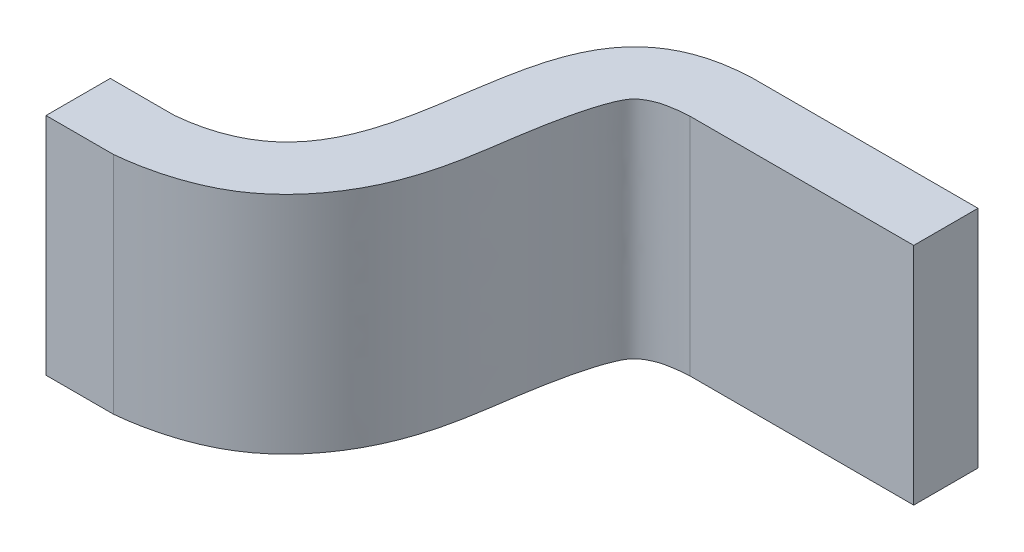
ISO-10303-21;
HEADER;
FILE_DESCRIPTION(('STEP AP214'),'2;1');
FILE_NAME('part.step','',(''),(''),'','','');
FILE_SCHEMA(('AUTOMOTIVE_DESIGN { 1 0 10303 214 1 1 1 1 }'));
ENDSEC;
DATA;
#1=APPLICATION_CONTEXT('core data for automotive mechanical design processes');
#2=APPLICATION_PROTOCOL_DEFINITION('international standard','automotive_design',2000,#1);
#3=PRODUCT_CONTEXT('',#1,'mechanical');
#4=PRODUCT('Part','Part','',(#3));
#5=PRODUCT_RELATED_PRODUCT_CATEGORY('part','',(#4));
#6=PRODUCT_DEFINITION_FORMATION('','',#4);
#7=PRODUCT_DEFINITION_CONTEXT('part definition',#1,'design');
#8=PRODUCT_DEFINITION('design','',#6,#7);
#9=PRODUCT_DEFINITION_SHAPE('','',#8);
#10=(LENGTH_UNIT() NAMED_UNIT(*) SI_UNIT(.MILLI.,.METRE.));
#11=(NAMED_UNIT(*) PLANE_ANGLE_UNIT() SI_UNIT($,.RADIAN.));
#12=(NAMED_UNIT(*) SI_UNIT($,.STERADIAN.) SOLID_ANGLE_UNIT());
#13=UNCERTAINTY_MEASURE_WITH_UNIT(LENGTH_MEASURE(1.E-05),#10,'distance_accuracy_value','');
#14=(GEOMETRIC_REPRESENTATION_CONTEXT(3) GLOBAL_UNCERTAINTY_ASSIGNED_CONTEXT((#13)) GLOBAL_UNIT_ASSIGNED_CONTEXT((#10,
#11,#12)) REPRESENTATION_CONTEXT('',''));
#15=CARTESIAN_POINT('',(0.,0.,0.));
#16=DIRECTION('',(0.,0.,1.));
#17=DIRECTION('',(1.,0.,0.));
#18=AXIS2_PLACEMENT_3D('',#15,#16,#17);
#19=CARTESIAN_POINT('',(0.381074398756027,0.523099170325608,1.2000000284124));
#20=DIRECTION('',(0.,1.,4.37113882867379E-08));
#21=DIRECTION('',(-1.,0.,0.));
#22=AXIS2_PLACEMENT_3D('',#19,#20,#21);
#23=PLANE('',#22);
#24=DIRECTION('',(1.,0.,0.));
#25=VECTOR('',#24,1.);
#26=CARTESIAN_POINT('',(8.21957818049203,0.523099214036997,0.200000028412402));
#27=LINE('',#26,#25);
#28=CARTESIAN_POINT('',(8.21957818049203,0.523099214036996,0.200000028412402));
#29=VERTEX_POINT('',#28);
#30=CARTESIAN_POINT('',(8.91607439875603,0.523099214036996,0.200000028412402));
#31=VERTEX_POINT('',#30);
#32=EDGE_CURVE('E11',#29,#31,#27,.T.);
#33=ORIENTED_EDGE('',*,*,#32,.F.);
#34=CARTESIAN_POINT('',(8.21957818049203,0.523099214036996,0.200000028412402));
#35=CARTESIAN_POINT('',(8.21401047042364,0.523099214027263,0.200222689522129));
#36=CARTESIAN_POINT('',(8.2084492375196,0.52309921401197,0.200572554479812));
#37=CARTESIAN_POINT('',(8.19734075645456,0.523099213971401,0.201500686980735));
#38=CARTESIAN_POINT('',(8.19179352491145,0.523099213946115,0.202079155292227));
#39=CARTESIAN_POINT('',(8.1806812900785,0.523099213886489,0.203443235011885));
#40=CARTESIAN_POINT('',(8.17511647873245,0.52309921385208,0.204230406804731));
#41=CARTESIAN_POINT('',(8.16402483417436,0.523099213773333,0.206031938032742));
#42=CARTESIAN_POINT('',(8.15849799412173,0.523099213728996,0.207046255379066));
#43=CARTESIAN_POINT('',(8.14658674806992,0.523099213616172,0.209627352515907));
#44=CARTESIAN_POINT('',(8.14021486717337,0.523099213544873,0.211258445573229));
#45=CARTESIAN_POINT('',(8.12922884181096,0.523099213386304,0.214886194813636));
#46=CARTESIAN_POINT('',(8.12455816053053,0.523099213306908,0.216702673148475));
#47=CARTESIAN_POINT('',(8.11576316126025,0.523099213130285,0.220743053151341));
#48=CARTESIAN_POINT('',(8.11162296951039,0.523099213034502,0.222933941860097));
#49=CARTESIAN_POINT('',(8.10254423156373,0.52309921280851,0.228105201448087));
#50=CARTESIAN_POINT('',(8.09763875402522,0.523099212675429,0.231151708136344));
#51=CARTESIAN_POINT('',(8.09023645619511,0.523099212418264,0.237031406996282));
#52=CARTESIAN_POINT('',(8.08750404217203,0.523099212307858,0.239554098690419));
#53=CARTESIAN_POINT('',(8.08247327048636,0.523099212070041,0.245002743933273));
#54=CARTESIAN_POINT('',(8.08017570164472,0.523099211942599,0.24792941399559));
#55=CARTESIAN_POINT('',(8.07600750655781,0.523099211678791,0.253960548834216));
#56=CARTESIAN_POINT('',(8.0741279129576,0.523099211542714,0.257059016316078));
#57=CARTESIAN_POINT('',(8.07061884711942,0.523099211266161,0.263392895839743));
#58=CARTESIAN_POINT('',(8.06898949912774,0.523099211125682,0.266628374896966));
#59=CARTESIAN_POINT('',(8.06368568552224,0.523099210637886,0.277849874002462));
#60=CARTESIAN_POINT('',(8.0604132563502,0.523099210281663,0.286022060199967));
#61=CARTESIAN_POINT('',(8.05219767575064,0.52309920930258,0.308422171614174));
#62=CARTESIAN_POINT('',(8.04772694785476,0.523099208670707,0.322813264888977));
#63=CARTESIAN_POINT('',(8.03962993037267,0.523099207415631,0.351469930130034));
#64=CARTESIAN_POINT('',(8.03598677320327,0.523099206792557,0.365730933740905));
#65=CARTESIAN_POINT('',(8.0292057912753,0.52309920554127,0.394362148604284));
#66=CARTESIAN_POINT('',(8.026067670572,0.523099204913059,0.408732290694727));
#67=CARTESIAN_POINT('',(8.01737649852023,0.523099203059267,0.451139552140372));
#68=CARTESIAN_POINT('',(8.01233758089064,0.52309920182914,0.479282765244955));
#69=CARTESIAN_POINT('',(8.0033688768371,0.523099199358243,0.535811203708825));
#70=CARTESIAN_POINT('',(7.99944209123785,0.523099198117453,0.564196874894819));
#71=CARTESIAN_POINT('',(7.99171406777027,0.523099195864869,0.615729796034541));
#72=CARTESIAN_POINT('',(7.98801955213797,0.523099194852412,0.638892139061332));
#73=CARTESIAN_POINT('',(7.97944793328662,0.52309919283672,0.685005838505779));
#74=CARTESIAN_POINT('',(7.97457098452208,0.523099191833482,0.707957222073791));
#75=CARTESIAN_POINT('',(7.96312511462686,0.523099189850104,0.753331627106404));
#76=CARTESIAN_POINT('',(7.95656434385538,0.523099188869875,0.775756641066975));
#77=CARTESIAN_POINT('',(7.94138023978948,0.523099186940585,0.819893680216221));
#78=CARTESIAN_POINT('',(7.93275798105253,0.523099185991507,0.841606070178963));
#79=CARTESIAN_POINT('',(7.91045031887107,0.523099183869217,0.890158404680553));
#80=CARTESIAN_POINT('',(7.89602176505835,0.523099182710677,0.916662671017734));
#81=CARTESIAN_POINT('',(7.86348674764205,0.523099180492291,0.967413431258293));
#82=CARTESIAN_POINT('',(7.84537217243352,0.523099179432669,0.991654770611745));
#83=CARTESIAN_POINT('',(7.80791242379023,0.523099177574198,1.03417163444858));
#84=CARTESIAN_POINT('',(7.78898672481745,0.523099176759306,1.0528141777067));
#85=CARTESIAN_POINT('',(7.74845805610151,0.523099175272559,1.08682698482442));
#86=CARTESIAN_POINT('',(7.72686395650978,0.523099174600248,1.10220765192534));
#87=CARTESIAN_POINT('',(7.68360712676313,0.523099173481253,1.12780728885139));
#88=CARTESIAN_POINT('',(7.66215097272192,0.523099173019081,1.13838054359417));
#89=CARTESIAN_POINT('',(7.61807803282734,0.523099172208481,1.15692492218508));
#90=CARTESIAN_POINT('',(7.59545709543127,0.523099171860497,1.16488586802287));
#91=CARTESIAN_POINT('',(7.54849735175116,0.523099171251631,1.17881510607821));
#92=CARTESIAN_POINT('',(7.52412722595023,0.523099170995436,1.18467615175865));
#93=CARTESIAN_POINT('',(7.47515350623731,0.523099170586624,1.19402868396041));
#94=CARTESIAN_POINT('',(7.45055381030961,0.523099170433121,1.19754041861071));
#95=CARTESIAN_POINT('',(7.42587357560403,0.523099170325609,1.2000000284124));
#96=B_SPLINE_CURVE_WITH_KNOTS('',3,(#34,#35,#36,#37,#38,#39,#40,#41,#42,#43,#44,#45,#46,#47,#48,
#49,#50,#51,#52,#53,#54,#55,#56,#57,#58,#59,#60,#61,#62,#63,#64,#65,#66,#67,#68,#69,#70,#71,#72,
#73,#74,#75,#76,#77,#78,#79,#80,#81,#82,#83,#84,#85,#86,#87,#88,#89,#90,#91,#92,#93,#94,#95),
.UNSPECIFIED.,.F.,.F.,(4,2,2,2,2,2,2,2,2,2,2,2,2,2,2,2,2,2,2,2,2,2,2,2,2,2,2,2,2,2,4),(0.,
0.0167129049826574,0.0334405206169266,0.0502969119078462,0.0671501823813316,0.086844997792569,
0.101838970321099,0.115885127156855,0.133132127804881,0.144236213112229,0.155360252414292,
0.166215762863012,0.177076645740442,0.203446553112077,0.248618617741093,0.292765096579114,
0.336885611219413,0.42262238002304,0.508588331833535,0.578941414817071,0.649285312924718,
0.719294937731862,0.789268149044624,0.879502218060837,0.969937050040235,1.04934324822107,
1.12849225200605,1.20002463783801,1.27183250557102,1.34691026454657,1.42133231106535),.UNSPECIFIED.);
#97=CARTESIAN_POINT('',(7.42587357560403,0.523099170325608,1.2000000284124));
#98=VERTEX_POINT('',#97);
#99=EDGE_CURVE('E186',#29,#98,#96,.T.);
#100=ORIENTED_EDGE('',*,*,#99,.T.);
#101=DIRECTION('',(1.,0.,0.));
#102=VECTOR('',#101,1.);
#103=CARTESIAN_POINT('',(7.21607439875603,0.523099170325608,1.2000000284124));
#104=LINE('',#103,#102);
#105=CARTESIAN_POINT('',(7.21607439875603,0.523099170325608,1.2000000284124));
#106=VERTEX_POINT('',#105);
#107=EDGE_CURVE('E163',#106,#98,#104,.T.);
#108=ORIENTED_EDGE('',*,*,#107,.F.);
#109=DIRECTION('',(0.,4.37113883977602E-08,-0.999999999999999));
#110=VECTOR('',#109,1.);
#111=CARTESIAN_POINT('',(7.21607439875603,0.523099170325608,1.2000000284124));
#112=LINE('',#111,#110);
#113=CARTESIAN_POINT('',(7.21607439875603,0.523099179067886,1.0000000284124));
#114=VERTEX_POINT('',#113);
#115=EDGE_CURVE('E155',#106,#114,#112,.T.);
#116=ORIENTED_EDGE('',*,*,#115,.T.);
#117=DIRECTION('',(-1.,0.,0.));
#118=VECTOR('',#117,1.);
#119=CARTESIAN_POINT('',(7.41607439875603,0.523099179067886,1.0000000284124));
#120=LINE('',#119,#118);
#121=CARTESIAN_POINT('',(7.41607439875603,0.523099179067886,1.0000000284124));
#122=VERTEX_POINT('',#121);
#123=EDGE_CURVE('E148',#122,#114,#120,.T.);
#124=ORIENTED_EDGE('',*,*,#123,.F.);
#125=CARTESIAN_POINT('',(8.21607439875603,0.523099222779274,2.84124024121632E-08));
#126=CARTESIAN_POINT('',(8.19359750090305,0.523099222746405,0.000751973045807773));
#127=CARTESIAN_POINT('',(8.17102033253113,0.523099222668732,0.00252892635576605));
#128=CARTESIAN_POINT('',(8.12598549255526,0.523099222386471,0.00898631281109906));
#129=CARTESIAN_POINT('',(8.10353378116303,0.523099222180145,0.0137065199884034));
#130=CARTESIAN_POINT('',(8.06516605596456,0.523099221673949,0.0252869208885335));
#131=CARTESIAN_POINT('',(8.04901169028135,0.523099221410038,0.031324499649534));
#132=CARTESIAN_POINT('',(8.01790380459713,0.523099220776571,0.0458165330653715));
#133=CARTESIAN_POINT('',(8.00294442627384,0.523099220407577,0.0542581347862217));
#134=CARTESIAN_POINT('',(7.97582167191426,0.523099219594948,0.0728489137987578));
#135=CARTESIAN_POINT('',(7.96353091436025,0.52309921915947,0.0828114897177462));
#136=CARTESIAN_POINT('',(7.94070621502396,0.523099218207211,0.104596633966456));
#137=CARTESIAN_POINT('',(7.93017445817697,0.523099217690331,0.116421480619358));
#138=CARTESIAN_POINT('',(7.90935508116188,0.523099216502098,0.143605077884773));
#139=CARTESIAN_POINT('',(7.89940970116877,0.523099215819404,0.159223306458098));
#140=CARTESIAN_POINT('',(7.88179108799282,0.523099214399586,0.191704937205948));
#141=CARTESIAN_POINT('',(7.8741236490106,0.523099213662331,0.208571380664586));
#142=CARTESIAN_POINT('',(7.85832464058284,0.523099211903736,0.248803345104274));
#143=CARTESIAN_POINT('',(7.85090890706547,0.523099210870456,0.272442033282066));
#144=CARTESIAN_POINT('',(7.83820894045458,0.523099208781532,0.320231039974889));
#145=CARTESIAN_POINT('',(7.83292359852321,0.5230992077259,0.344381085428394));
#146=CARTESIAN_POINT('',(7.82020763349268,0.523099204851882,0.41013095442911));
#147=CARTESIAN_POINT('',(7.81392194525158,0.523099203024599,0.451934314660285));
#148=CARTESIAN_POINT('',(7.8012428083788,0.523099199360207,0.535765841283036));
#149=CARTESIAN_POINT('',(7.79484895474965,0.5230991975231,0.577793964269862));
#150=CARTESIAN_POINT('',(7.78273984807099,0.523099194831536,0.6393697611756));
#151=CARTESIAN_POINT('',(7.77842057810017,0.523099193965965,0.659171695464004));
#152=CARTESIAN_POINT('',(7.76847573352189,0.523099192248105,0.698471750789638));
#153=CARTESIAN_POINT('',(7.76284917548215,0.523099191395826,0.717969631254135));
#154=CARTESIAN_POINT('',(7.74981596903728,0.523099189726678,0.756155277243099));
#155=CARTESIAN_POINT('',(7.74242864611761,0.523099188909532,0.774849402330933));
#156=CARTESIAN_POINT('',(7.72530005700014,0.523099187324708,0.811105960776874));
#157=CARTESIAN_POINT('',(7.71556458954354,0.523099186556914,0.828671049014009));
#158=CARTESIAN_POINT('',(7.69292951988902,0.523099185076476,0.862539528703549));
#159=CARTESIAN_POINT('',(7.67993520495926,0.523099184366525,0.878781289982295));
#160=CARTESIAN_POINT('',(7.65100399267901,0.523099183072226,0.908391388716109));
#161=CARTESIAN_POINT('',(7.63506980602138,0.523099182487762,0.92176234880261));
#162=CARTESIAN_POINT('',(7.60252456066282,0.523099181513851,0.944042841853134));
#163=CARTESIAN_POINT('',(7.58611569627056,0.523099181111289,0.9532524144854));
#164=CARTESIAN_POINT('',(7.55201487673193,0.523099180421609,0.969030441043198));
#165=CARTESIAN_POINT('',(7.53431790582258,0.523099180134976,0.975587838389975));
#166=CARTESIAN_POINT('',(7.4998876879737,0.523099179685129,0.985879127327204));
#167=CARTESIAN_POINT('',(7.48321202321778,0.523099179513099,0.989814734575921));
#168=CARTESIAN_POINT('',(7.44972396115948,0.523099179241149,0.996036229262667));
#169=CARTESIAN_POINT('',(7.43291463042139,0.523099179140522,0.998338325880507));
#170=CARTESIAN_POINT('',(7.41607439875603,0.523099179067885,1.0000000284124));
#171=B_SPLINE_CURVE_WITH_KNOTS('',3,(#125,#126,#127,#128,#129,#130,#131,#132,#133,#134,#135,
#136,#137,#138,#139,#140,#141,#142,#143,#144,#145,#146,#147,#148,#149,#150,#151,#152,#153,#154,
#155,#156,#157,#158,#159,#160,#161,#162,#163,#164,#165,#166,#167,#168,#169,#170),.UNSPECIFIED.,
.F.,.F.,(4,2,2,2,2,2,2,2,2,2,2,2,2,2,2,2,2,2,2,2,2,2,4),(0.,0.0676605368254357,
0.136255841823746,0.187815232472052,0.239103979458826,0.286357475935169,0.333669238509407,
0.388978971846573,0.444428210357162,0.518581097757565,0.592695339665638,0.719482422739696,
0.846974988060582,0.90774680548486,0.96856448853661,1.02874313069962,1.08877465652057,
1.15080863583324,1.21278570033355,1.26897458836371,1.32539536427915,1.3767136749948,
1.42751535438906),.UNSPECIFIED.);
#172=CARTESIAN_POINT('',(8.21607439875603,0.523099222779274,2.84124023863797E-08));
#173=VERTEX_POINT('',#172);
#174=EDGE_CURVE('E99',#173,#122,#171,.T.);
#175=ORIENTED_EDGE('',*,*,#174,.F.);
#176=DIRECTION('',(1.,0.,0.));
#177=VECTOR('',#176,1.);
#178=CARTESIAN_POINT('',(8.21607439875603,0.523099222779274,2.84124023863797E-08));
#179=LINE('',#178,#177);
#180=CARTESIAN_POINT('',(8.91607439875603,0.523099222779274,2.84124023863797E-08));
#181=VERTEX_POINT('',#180);
#182=EDGE_CURVE('E93',#173,#181,#179,.T.);
#183=ORIENTED_EDGE('',*,*,#182,.T.);
#184=DIRECTION('',(0.,4.37113883977602E-08,-0.999999999999999));
#185=VECTOR('',#184,1.);
#186=CARTESIAN_POINT('',(8.91607439875603,0.523099214036996,0.200000028412402));
#187=LINE('',#186,#185);
#188=EDGE_CURVE('E194',#31,#181,#187,.T.);
#189=ORIENTED_EDGE('',*,*,#188,.F.);
#190=EDGE_LOOP('',(#33,#100,#108,#116,#124,#175,#183,#189));
#191=FACE_BOUND('',#190,.T.);
#192=ADVANCED_FACE('F17',(#191),#23,.F.);
#193=CARTESIAN_POINT('',(8.91607439875603,-0.126900829674392,1.2));
#194=DIRECTION('',(-1.,0.,0.));
#195=DIRECTION('',(0.,-1.,-4.37113882867379E-08));
#196=AXIS2_PLACEMENT_3D('',#193,#194,#195);
#197=PLANE('',#196);
#198=DIRECTION('',(0.,-0.999999999999999,-4.37113881598552E-08));
#199=VECTOR('',#198,1.);
#200=CARTESIAN_POINT('',(8.91607439875603,1.223099214037,0.200000059010374));
#201=LINE('',#200,#199);
#202=CARTESIAN_POINT('',(8.91607439875603,1.223099214037,0.200000059010374));
#203=VERTEX_POINT('',#202);
#204=EDGE_CURVE('E25',#203,#31,#201,.T.);
#205=ORIENTED_EDGE('',*,*,#204,.T.);
#206=ORIENTED_EDGE('',*,*,#188,.T.);
#207=DIRECTION('',(0.,0.999999999999999,4.37113882867379E-08));
#208=VECTOR('',#207,1.);
#209=CARTESIAN_POINT('',(8.91607439875603,0.523099222779274,2.84124023863797E-08));
#210=LINE('',#209,#208);
#211=CARTESIAN_POINT('',(8.91607439875603,1.22309922277927,5.90103741870962E-08));
#212=VERTEX_POINT('',#211);
#213=EDGE_CURVE('E157',#181,#212,#210,.T.);
#214=ORIENTED_EDGE('',*,*,#213,.T.);
#215=DIRECTION('',(0.,4.37113878426487E-08,-0.999999999999999));
#216=VECTOR('',#215,1.);
#217=CARTESIAN_POINT('',(8.91607439875603,1.223099214037,0.200000059010374));
#218=LINE('',#217,#216);
#219=EDGE_CURVE('E150',#203,#212,#218,.T.);
#220=ORIENTED_EDGE('',*,*,#219,.F.);
#221=EDGE_LOOP('',(#205,#206,#214,#220));
#222=FACE_BOUND('',#221,.T.);
#223=ADVANCED_FACE('F205',(#222),#197,.F.);
#224=CARTESIAN_POINT('',(0.381074398756027,1.22309917032561,1.20000005901037));
#225=DIRECTION('',(0.,1.,4.37113882867379E-08));
#226=DIRECTION('',(-1.,0.,0.));
#227=AXIS2_PLACEMENT_3D('',#224,#225,#226);
#228=PLANE('',#227);
#229=CARTESIAN_POINT('',(8.21957818049203,1.223099214037,0.200000059010374));
#230=CARTESIAN_POINT('',(8.21401047042364,1.22309921402726,0.2002227201201));
#231=CARTESIAN_POINT('',(8.2084492375196,1.22309921401197,0.200572585077783));
#232=CARTESIAN_POINT('',(8.19734075645456,1.2230992139714,0.201500717578706));
#233=CARTESIAN_POINT('',(8.19179352491145,1.22309921394611,0.202079185890199));
#234=CARTESIAN_POINT('',(8.1806812900785,1.22309921388649,0.203443265609857));
#235=CARTESIAN_POINT('',(8.17511647873245,1.22309921385208,0.204230437402703));
#236=CARTESIAN_POINT('',(8.16402483417436,1.22309921377333,0.206031968630714));
#237=CARTESIAN_POINT('',(8.15849799412173,1.223099213729,0.207046285977038));
#238=CARTESIAN_POINT('',(8.14658674806992,1.22309921361617,0.209627383113879));
#239=CARTESIAN_POINT('',(8.14021486717337,1.22309921354488,0.211258476171201));
#240=CARTESIAN_POINT('',(8.12922884181096,1.22309921338629,0.214886225411608));
#241=CARTESIAN_POINT('',(8.12455816053053,1.22309921330689,0.216702703746447));
#242=CARTESIAN_POINT('',(8.11576316126025,1.2230992131303,0.220743083749313));
#243=CARTESIAN_POINT('',(8.11162296951039,1.22309921303456,0.222933972458069));
#244=CARTESIAN_POINT('',(8.10254423156373,1.22309921280844,0.228105232046058));
#245=CARTESIAN_POINT('',(8.09763875402522,1.22309921267514,0.231151738734315));
#246=CARTESIAN_POINT('',(8.09023645619511,1.22309921241836,0.237031437594254));
#247=CARTESIAN_POINT('',(8.08750404217203,1.2230992123083,0.239554129288392));
#248=CARTESIAN_POINT('',(8.08247327048636,1.2230992120696,0.245002774531246));
#249=CARTESIAN_POINT('',(8.08017570164472,1.22309921194094,0.247929444593562));
#250=CARTESIAN_POINT('',(8.07600750655781,1.22309921167758,0.253960579432188));
#251=CARTESIAN_POINT('',(8.0741279129576,1.2230992115431,0.25705904691405));
#252=CARTESIAN_POINT('',(8.07061884711942,1.22309921126577,0.263392926437715));
#253=CARTESIAN_POINT('',(8.06898949912774,1.22309921112292,0.266628405494938));
#254=CARTESIAN_POINT('',(8.06368568552224,1.22309921062833,0.277849904600434));
#255=CARTESIAN_POINT('',(8.0604132563502,1.22309921026963,0.286022090797939));
#256=CARTESIAN_POINT('',(8.05219767575064,1.2230992092904,0.308422202212146));
#257=CARTESIAN_POINT('',(8.04772694785476,1.22309920866558,0.322813295486949));
#258=CARTESIAN_POINT('',(8.03962993037267,1.22309920741664,0.351469960728006));
#259=CARTESIAN_POINT('',(8.03598677320327,1.22309920679284,0.365730964338877));
#260=CARTESIAN_POINT('',(8.0292057912753,1.22309920554099,0.394362179202256));
#261=CARTESIAN_POINT('',(8.026067670572,1.22309920491295,0.408732321292699));
#262=CARTESIAN_POINT('',(8.01737649852023,1.22309920305944,0.451139582738344));
#263=CARTESIAN_POINT('',(8.01233758089064,1.22309920182919,0.479282795842927));
#264=CARTESIAN_POINT('',(8.0033688768371,1.2230991993582,0.535811234306797));
#265=CARTESIAN_POINT('',(7.99944209123786,1.22309919811744,0.564196905492791));
#266=CARTESIAN_POINT('',(7.99171406777027,1.22309919586488,0.615729826632513));
#267=CARTESIAN_POINT('',(7.98801955213797,1.22309919485241,0.638892169659303));
#268=CARTESIAN_POINT('',(7.97944793328662,1.22309919283672,0.68500586910375));
#269=CARTESIAN_POINT('',(7.97457098452208,1.22309919183348,0.707957252671764));
#270=CARTESIAN_POINT('',(7.96312511462686,1.2230991898501,0.753331657704377));
#271=CARTESIAN_POINT('',(7.95656434385538,1.22309918886988,0.775756671664948));
#272=CARTESIAN_POINT('',(7.94138023978948,1.22309918694058,0.819893710814193));
#273=CARTESIAN_POINT('',(7.93275798105253,1.22309918599151,0.841606100776935));
#274=CARTESIAN_POINT('',(7.91045031887107,1.22309918386922,0.890158435278525));
#275=CARTESIAN_POINT('',(7.89602176505836,1.22309918271068,0.916662701615706));
#276=CARTESIAN_POINT('',(7.86348674764205,1.22309918049229,0.967413461856264));
#277=CARTESIAN_POINT('',(7.84537217243352,1.22309917943267,0.991654801209715));
#278=CARTESIAN_POINT('',(7.80791242379023,1.22309917757419,1.03417166504655));
#279=CARTESIAN_POINT('',(7.78898672481745,1.22309917675931,1.05281420830467));
#280=CARTESIAN_POINT('',(7.74845805610151,1.22309917527256,1.08682701542239));
#281=CARTESIAN_POINT('',(7.72686395650978,1.22309917460025,1.1022076825233));
#282=CARTESIAN_POINT('',(7.68360712676313,1.22309917348125,1.12780731944936));
#283=CARTESIAN_POINT('',(7.66215097272193,1.22309917301908,1.13838057419214));
#284=CARTESIAN_POINT('',(7.61807803282734,1.22309917220848,1.15692495278306));
#285=CARTESIAN_POINT('',(7.59545709543127,1.2230991718605,1.16488589862084));
#286=CARTESIAN_POINT('',(7.54849735175116,1.22309917125163,1.17881513667617));
#287=CARTESIAN_POINT('',(7.52412722595023,1.22309917099544,1.18467618235662));
#288=CARTESIAN_POINT('',(7.47515350623731,1.22309917058662,1.19402871455839));
#289=CARTESIAN_POINT('',(7.45055381030962,1.22309917043312,1.19754044920868));
#290=CARTESIAN_POINT('',(7.42587357560403,1.22309917032561,1.20000005901037));
#291=B_SPLINE_CURVE_WITH_KNOTS('',3,(#229,#230,#231,#232,#233,#234,#235,#236,#237,#238,#239,
#240,#241,#242,#243,#244,#245,#246,#247,#248,#249,#250,#251,#252,#253,#254,#255,#256,#257,#258,
#259,#260,#261,#262,#263,#264,#265,#266,#267,#268,#269,#270,#271,#272,#273,#274,#275,#276,#277,
#278,#279,#280,#281,#282,#283,#284,#285,#286,#287,#288,#289,#290),.UNSPECIFIED.,.F.,.F.,(4,2,2,
2,2,2,2,2,2,2,2,2,2,2,2,2,2,2,2,2,2,2,2,2,2,2,2,2,2,2,4),(0.,0.0167129049826574,
0.0334405206169266,0.0502969119078462,0.0671501823813316,0.086844997792569,0.101838970321099,
0.115885127156855,0.133132127804881,0.144236213112228,0.155360252414292,0.166215762863012,
0.177076645740442,0.203446553112077,0.248618617741093,0.292765096579114,0.336885611219413,
0.42262238002304,0.508588331833535,0.578941414817071,0.649285312924717,0.719294937731863,
0.789268149044624,0.879502218060836,0.969937050040234,1.04934324822107,1.12849225200605,
1.200024637838,1.27183250557102,1.34691026454657,1.42133231106535),.UNSPECIFIED.);
#292=CARTESIAN_POINT('',(8.21957818049203,1.223099214037,0.200000059010374));
#293=VERTEX_POINT('',#292);
#294=CARTESIAN_POINT('',(7.42587357560403,1.22309917032561,1.20000005901037));
#295=VERTEX_POINT('',#294);
#296=EDGE_CURVE('E180',#293,#295,#291,.T.);
#297=ORIENTED_EDGE('',*,*,#296,.F.);
#298=DIRECTION('',(1.,0.,0.));
#299=VECTOR('',#298,1.);
#300=CARTESIAN_POINT('',(8.21957818049203,1.223099214037,0.200000059010374));
#301=LINE('',#300,#299);
#302=EDGE_CURVE('E159',#293,#203,#301,.T.);
#303=ORIENTED_EDGE('',*,*,#302,.T.);
#304=ORIENTED_EDGE('',*,*,#219,.T.);
#305=DIRECTION('',(1.,0.,0.));
#306=VECTOR('',#305,1.);
#307=CARTESIAN_POINT('',(8.21607439875603,1.22309922277927,5.90103741870962E-08));
#308=LINE('',#307,#306);
#309=CARTESIAN_POINT('',(8.21607439875603,1.22309922277927,5.90103741870962E-08));
#310=VERTEX_POINT('',#309);
#311=EDGE_CURVE('E89',#310,#212,#308,.T.);
#312=ORIENTED_EDGE('',*,*,#311,.F.);
#313=CARTESIAN_POINT('',(8.21607439875603,1.22309922277927,5.90103741684708E-08));
#314=CARTESIAN_POINT('',(8.19359750090305,1.22309922274641,0.000752003643779512));
#315=CARTESIAN_POINT('',(8.17102033253113,1.22309922266873,0.00252895695373783));
#316=CARTESIAN_POINT('',(8.12598549255526,1.22309922238647,0.00898634340907094));
#317=CARTESIAN_POINT('',(8.10353378116303,1.22309922218014,0.0137065505863754));
#318=CARTESIAN_POINT('',(8.06516605596456,1.22309922167395,0.0252869514865054));
#319=CARTESIAN_POINT('',(8.04901169028135,1.22309922141004,0.0313245302475058));
#320=CARTESIAN_POINT('',(8.01790380459713,1.22309922077657,0.0458165636633433));
#321=CARTESIAN_POINT('',(8.00294442627384,1.22309922040757,0.0542581653841935));
#322=CARTESIAN_POINT('',(7.97582167191426,1.22309921959494,0.0728489443967297));
#323=CARTESIAN_POINT('',(7.96353091436025,1.22309921915947,0.0828115203157181));
#324=CARTESIAN_POINT('',(7.94070621502396,1.22309921820721,0.104596664564428));
#325=CARTESIAN_POINT('',(7.93017445817697,1.22309921769033,0.11642151121733));
#326=CARTESIAN_POINT('',(7.90935508116188,1.2230992165021,0.143605108482745));
#327=CARTESIAN_POINT('',(7.89940970116876,1.2230992158194,0.15922333705607));
#328=CARTESIAN_POINT('',(7.88179108799282,1.22309921439959,0.19170496780392));
#329=CARTESIAN_POINT('',(7.8741236490106,1.22309921366233,0.208571411262558));
#330=CARTESIAN_POINT('',(7.85832464058284,1.22309921190374,0.248803375702246));
#331=CARTESIAN_POINT('',(7.85090890706547,1.22309921087046,0.272442063880038));
#332=CARTESIAN_POINT('',(7.83820894045458,1.22309920878153,0.320231070572861));
#333=CARTESIAN_POINT('',(7.83292359852321,1.2230992077259,0.344381116026366));
#334=CARTESIAN_POINT('',(7.82020763349268,1.22309920485188,0.410130985027082));
#335=CARTESIAN_POINT('',(7.81392194525158,1.2230992030246,0.451934345258257));
#336=CARTESIAN_POINT('',(7.8012428083788,1.2230991993602,0.535765871881008));
#337=CARTESIAN_POINT('',(7.79484895474965,1.22309919752309,0.577793994867834));
#338=CARTESIAN_POINT('',(7.78273984807099,1.22309919483153,0.639369791773572));
#339=CARTESIAN_POINT('',(7.77842057810017,1.22309919396596,0.659171726061976));
#340=CARTESIAN_POINT('',(7.76847573352189,1.22309919224811,0.69847178138761));
#341=CARTESIAN_POINT('',(7.76284917548215,1.22309919139583,0.717969661852107));
#342=CARTESIAN_POINT('',(7.74981596903728,1.22309918972668,0.75615530784107));
#343=CARTESIAN_POINT('',(7.74242864611761,1.22309918890953,0.774849432928905));
#344=CARTESIAN_POINT('',(7.72530005700014,1.22309918732471,0.811105991374846));
#345=CARTESIAN_POINT('',(7.71556458954354,1.22309918655692,0.828671079611981));
#346=CARTESIAN_POINT('',(7.69292951988902,1.22309918507648,0.86253955930152));
#347=CARTESIAN_POINT('',(7.67993520495926,1.22309918436653,0.878781320580266));
#348=CARTESIAN_POINT('',(7.65100399267901,1.22309918307222,0.908391419314081));
#349=CARTESIAN_POINT('',(7.63506980602138,1.22309918248776,0.921762379400582));
#350=CARTESIAN_POINT('',(7.60252456066282,1.22309918151385,0.944042872451106));
#351=CARTESIAN_POINT('',(7.58611569627056,1.22309918111129,0.953252445083371));
#352=CARTESIAN_POINT('',(7.55201487673193,1.22309918042161,0.96903047164117));
#353=CARTESIAN_POINT('',(7.53431790582258,1.22309918013498,0.975587868987947));
#354=CARTESIAN_POINT('',(7.4998876879737,1.22309917968513,0.985879157925176));
#355=CARTESIAN_POINT('',(7.48321202321778,1.2230991795131,0.989814765173893));
#356=CARTESIAN_POINT('',(7.44972396115948,1.22309917924115,0.996036259860638));
#357=CARTESIAN_POINT('',(7.43291463042139,1.22309917914052,0.998338356478477));
#358=CARTESIAN_POINT('',(7.41607439875603,1.22309917906788,1.00000005901037));
#359=B_SPLINE_CURVE_WITH_KNOTS('',3,(#313,#314,#315,#316,#317,#318,#319,#320,#321,#322,#323,
#324,#325,#326,#327,#328,#329,#330,#331,#332,#333,#334,#335,#336,#337,#338,#339,#340,#341,#342,
#343,#344,#345,#346,#347,#348,#349,#350,#351,#352,#353,#354,#355,#356,#357,#358),.UNSPECIFIED.,
.F.,.F.,(4,2,2,2,2,2,2,2,2,2,2,2,2,2,2,2,2,2,2,2,2,2,4),(0.,0.0676605368254357,
0.136255841823746,0.187815232472052,0.239103979458826,0.286357475935169,0.333669238509407,
0.388978971846573,0.444428210357162,0.518581097757565,0.592695339665638,0.719482422739696,
0.846974988060582,0.90774680548486,0.96856448853661,1.02874313069962,1.08877465652057,
1.15080863583324,1.21278570033355,1.26897458836371,1.32539536427915,1.3767136749948,
1.42751535438906),.UNSPECIFIED.);
#360=CARTESIAN_POINT('',(7.41607439875603,1.22309917906789,1.00000005901037));
#361=VERTEX_POINT('',#360);
#362=EDGE_CURVE('E81',#310,#361,#359,.T.);
#363=ORIENTED_EDGE('',*,*,#362,.T.);
#364=DIRECTION('',(-1.,0.,0.));
#365=VECTOR('',#364,1.);
#366=CARTESIAN_POINT('',(7.41607439875603,1.22309917906788,1.00000005901037));
#367=LINE('',#366,#365);
#368=CARTESIAN_POINT('',(7.21607439875603,1.22309917906789,1.00000005901037));
#369=VERTEX_POINT('',#368);
#370=EDGE_CURVE('E86',#361,#369,#367,.T.);
#371=ORIENTED_EDGE('',*,*,#370,.T.);
#372=DIRECTION('',(0.,4.37113878426487E-08,-0.999999999999999));
#373=VECTOR('',#372,1.);
#374=CARTESIAN_POINT('',(7.21607439875603,1.22309917032561,1.20000005901037));
#375=LINE('',#374,#373);
#376=CARTESIAN_POINT('',(7.21607439875603,1.22309917032561,1.20000005901037));
#377=VERTEX_POINT('',#376);
#378=EDGE_CURVE('E161',#377,#369,#375,.T.);
#379=ORIENTED_EDGE('',*,*,#378,.F.);
#380=DIRECTION('',(1.,0.,0.));
#381=VECTOR('',#380,1.);
#382=CARTESIAN_POINT('',(7.21607439875603,1.22309917032561,1.20000005901037));
#383=LINE('',#382,#381);
#384=EDGE_CURVE('E208',#377,#295,#383,.T.);
#385=ORIENTED_EDGE('',*,*,#384,.T.);
#386=EDGE_LOOP('',(#297,#303,#304,#312,#363,#371,#379,#385));
#387=FACE_BOUND('',#386,.T.);
#388=ADVANCED_FACE('F83',(#387),#228,.T.);
#389=CARTESIAN_POINT('',(7.21607439875603,-0.126900829674392,1.2));
#390=DIRECTION('',(-1.,0.,0.));
#391=DIRECTION('',(0.,-1.,-4.37113882867379E-08));
#392=AXIS2_PLACEMENT_3D('',#389,#390,#391);
#393=PLANE('',#392);
#394=ORIENTED_EDGE('',*,*,#378,.T.);
#395=DIRECTION('',(0.,-0.999999999999999,-4.37113881598552E-08));
#396=VECTOR('',#395,1.);
#397=CARTESIAN_POINT('',(7.21607439875603,1.22309917906789,1.00000005901037));
#398=LINE('',#397,#396);
#399=EDGE_CURVE('E107',#369,#114,#398,.T.);
#400=ORIENTED_EDGE('',*,*,#399,.T.);
#401=ORIENTED_EDGE('',*,*,#115,.F.);
#402=DIRECTION('',(0.,0.999999999999999,4.37113881598552E-08));
#403=VECTOR('',#402,1.);
#404=CARTESIAN_POINT('',(7.21607439875603,0.523099170325608,1.2000000284124));
#405=LINE('',#404,#403);
#406=EDGE_CURVE('E92',#106,#377,#405,.T.);
#407=ORIENTED_EDGE('',*,*,#406,.T.);
#408=EDGE_LOOP('',(#394,#400,#401,#407));
#409=FACE_BOUND('',#408,.T.);
#410=ADVANCED_FACE('F177',(#409),#393,.T.);
#411=CARTESIAN_POINT('',(0.381074398756027,-0.126900777220726,0.));
#412=DIRECTION('',(0.,-4.37113882867379E-08,1.));
#413=DIRECTION('',(0.,-1.,-4.37113882867379E-08));
#414=AXIS2_PLACEMENT_3D('',#411,#412,#413);
#415=PLANE('',#414);
#416=DIRECTION('',(0.,-0.999999999999999,-4.37113882867379E-08));
#417=VECTOR('',#416,1.);
#418=CARTESIAN_POINT('',(8.21607439875603,1.22309922277927,5.90103741870962E-08));
#419=LINE('',#418,#417);
#420=EDGE_CURVE('E153',#310,#173,#419,.T.);
#421=ORIENTED_EDGE('',*,*,#420,.F.);
#422=ORIENTED_EDGE('',*,*,#311,.T.);
#423=ORIENTED_EDGE('',*,*,#213,.F.);
#424=ORIENTED_EDGE('',*,*,#182,.F.);
#425=EDGE_LOOP('',(#421,#422,#423,#424));
#426=FACE_BOUND('',#425,.T.);
#427=ADVANCED_FACE('F129',(#426),#415,.F.);
#428=CARTESIAN_POINT('',(0.381074398756027,-0.126900829674392,1.2));
#429=DIRECTION('',(0.,-4.37113882867379E-08,1.));
#430=DIRECTION('',(0.,-1.,-4.37113882867379E-08));
#431=AXIS2_PLACEMENT_3D('',#428,#429,#430);
#432=PLANE('',#431);
#433=DIRECTION('',(0.,-0.999999999999999,-4.37113881598552E-08));
#434=VECTOR('',#433,1.);
#435=CARTESIAN_POINT('',(7.42587357560403,1.22309917032561,1.20000005901037));
#436=LINE('',#435,#434);
#437=EDGE_CURVE('E145',#295,#98,#436,.T.);
#438=ORIENTED_EDGE('',*,*,#437,.F.);
#439=ORIENTED_EDGE('',*,*,#384,.F.);
#440=ORIENTED_EDGE('',*,*,#406,.F.);
#441=ORIENTED_EDGE('',*,*,#107,.T.);
#442=EDGE_LOOP('',(#438,#439,#440,#441));
#443=FACE_BOUND('',#442,.T.);
#444=ADVANCED_FACE('F199',(#443),#432,.T.);
#445=CARTESIAN_POINT('',(0.381074398756027,5.01772964056189,1.00000022487894));
#446=DIRECTION('',(0.,4.37113882867379E-08,-1.));
#447=DIRECTION('',(0.,1.,4.37113882867379E-08));
#448=AXIS2_PLACEMENT_3D('',#445,#446,#447);
#449=PLANE('',#448);
#450=ORIENTED_EDGE('',*,*,#123,.T.);
#451=ORIENTED_EDGE('',*,*,#399,.F.);
#452=ORIENTED_EDGE('',*,*,#370,.F.);
#453=DIRECTION('',(0.,-0.999999999999999,-4.37113881598552E-08));
#454=VECTOR('',#453,1.);
#455=CARTESIAN_POINT('',(7.41607439875603,1.22309917906789,1.00000005901037));
#456=LINE('',#455,#454);
#457=EDGE_CURVE('E97',#361,#122,#456,.T.);
#458=ORIENTED_EDGE('',*,*,#457,.T.);
#459=EDGE_LOOP('',(#450,#451,#452,#458));
#460=FACE_BOUND('',#459,.T.);
#461=ADVANCED_FACE('F105',(#460),#449,.T.);
#462=CARTESIAN_POINT('',(7.41607439875603,5.01772964056189,1.00000022487894));
#463=CARTESIAN_POINT('',(8.06139179690003,5.01772964333266,0.93661226287194));
#464=CARTESIAN_POINT('',(7.55197768938303,5.01772968333384,0.0214920441178097));
#465=CARTESIAN_POINT('',(8.21607439875603,5.01772968427327,2.24878939694144E-07));
#466=B_SPLINE_CURVE_WITH_KNOTS('',3,(#462,#463,#464,#465),.UNSPECIFIED.,.F.,.F.,(4,4),(0.,1.),.UNSPECIFIED.);
#467=DIRECTION('',(0.,-0.999999999999999,-4.37113882867379E-08));
#468=VECTOR('',#467,1.);
#469=SURFACE_OF_LINEAR_EXTRUSION('',#466,#468);
#470=ORIENTED_EDGE('',*,*,#174,.T.);
#471=ORIENTED_EDGE('',*,*,#457,.F.);
#472=ORIENTED_EDGE('',*,*,#362,.F.);
#473=ORIENTED_EDGE('',*,*,#420,.T.);
#474=EDGE_LOOP('',(#470,#471,#472,#473));
#475=FACE_BOUND('',#474,.T.);
#476=ADVANCED_FACE('F98',(#475),#469,.T.);
#477=CARTESIAN_POINT('',(0.381074398756027,5.017729675531,0.20000022487894));
#478=DIRECTION('',(0.,-4.37113882867379E-08,1.));
#479=DIRECTION('',(-1.,0.,0.));
#480=AXIS2_PLACEMENT_3D('',#477,#478,#479);
#481=PLANE('',#480);
#482=ORIENTED_EDGE('',*,*,#32,.T.);
#483=ORIENTED_EDGE('',*,*,#204,.F.);
#484=ORIENTED_EDGE('',*,*,#302,.F.);
#485=DIRECTION('',(0.,-0.999999999999999,-4.37113881598552E-08));
#486=VECTOR('',#485,1.);
#487=CARTESIAN_POINT('',(8.21957818049203,1.223099214037,0.200000059010374));
#488=LINE('',#487,#486);
#489=EDGE_CURVE('E102',#293,#29,#488,.T.);
#490=ORIENTED_EDGE('',*,*,#489,.T.);
#491=EDGE_LOOP('',(#482,#483,#484,#490));
#492=FACE_BOUND('',#491,.T.);
#493=ADVANCED_FACE('F128',(#492),#481,.T.);
#494=CARTESIAN_POINT('',(7.42587357560403,5.01772963181961,1.20000022487894));
#495=CARTESIAN_POINT('',(7.52324797711103,5.0177296322377,1.19043537372094));
#496=CARTESIAN_POINT('',(7.72759639244103,5.01772963465043,1.13523848292794));
#497=CARTESIAN_POINT('',(7.96818915500203,5.01772964683219,0.85655227210794));
#498=CARTESIAN_POINT('',(8.00048622477203,5.01772966268883,0.49379478761794));
#499=CARTESIAN_POINT('',(8.06033428941003,5.01772967295241,0.25899132482694));
#500=CARTESIAN_POINT('',(8.09819089651203,5.01772967426447,0.22897490490494));
#501=CARTESIAN_POINT('',(8.14113192410003,5.01772967516896,0.20828275194794));
#502=CARTESIAN_POINT('',(8.19604029615203,5.01772967549165,0.20090043049794));
#503=CARTESIAN_POINT('',(8.21957818049203,5.017729675531,0.20000022487894));
#504=B_SPLINE_CURVE_WITH_KNOTS('',3,(#494,#495,#496,#497,#498,#499,#500,#501,#502,#503),
.UNSPECIFIED.,.F.,.F.,(4,1,1,1,1,1,1,4),(-0.005037439357121,0.120331553469,0.245700546295,
0.496438531947,0.747176517599,0.872545510425,0.935230006838,0.997914503251),.UNSPECIFIED.);
#505=DIRECTION('',(0.,-0.999999999999999,-4.37113882867379E-08));
#506=VECTOR('',#505,1.);
#507=SURFACE_OF_LINEAR_EXTRUSION('',#504,#506);
#508=ORIENTED_EDGE('',*,*,#489,.F.);
#509=ORIENTED_EDGE('',*,*,#296,.T.);
#510=ORIENTED_EDGE('',*,*,#437,.T.);
#511=ORIENTED_EDGE('',*,*,#99,.F.);
#512=EDGE_LOOP('',(#508,#509,#510,#511));
#513=FACE_BOUND('',#512,.T.);
#514=ADVANCED_FACE('F172',(#513),#507,.F.);
#515=CLOSED_SHELL('',(#192,#223,#388,#410,#427,#444,#461,#476,#493,#514));
#516=MANIFOLD_SOLID_BREP('B1',#515);
#517=ADVANCED_BREP_SHAPE_REPRESENTATION('',(#18,#516),#14);
#518=SHAPE_DEFINITION_REPRESENTATION(#9,#517);
ENDSEC;
END-ISO-10303-21;
